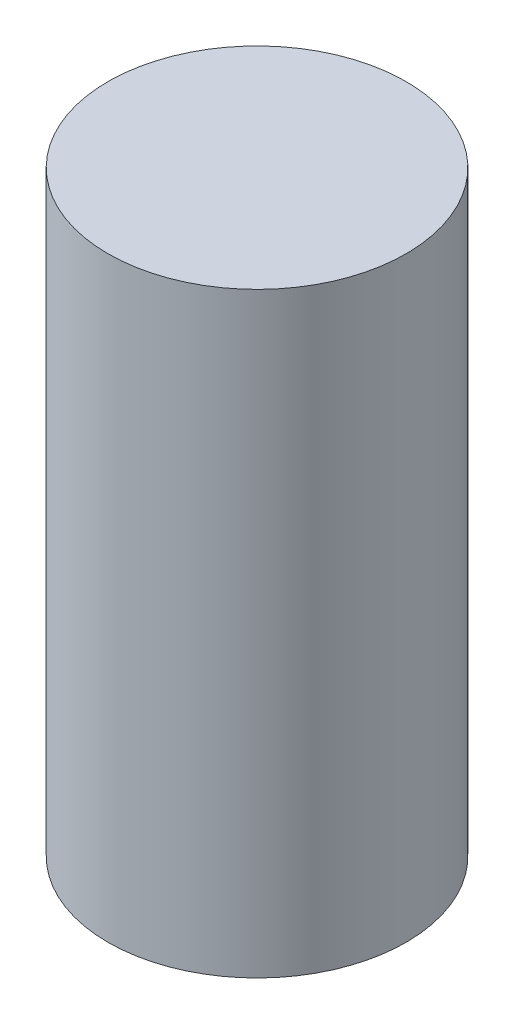
ISO-10303-21;
HEADER;
FILE_DESCRIPTION(('STEP AP214'),'2;1');
FILE_NAME('part.step','',(''),(''),'','','');
FILE_SCHEMA(('AUTOMOTIVE_DESIGN { 1 0 10303 214 1 1 1 1 }'));
ENDSEC;
DATA;
#1=APPLICATION_CONTEXT('core data for automotive mechanical design processes');
#2=APPLICATION_PROTOCOL_DEFINITION('international standard','automotive_design',2000,#1);
#3=PRODUCT_CONTEXT('',#1,'mechanical');
#4=PRODUCT('Part','Part','',(#3));
#5=PRODUCT_RELATED_PRODUCT_CATEGORY('part','',(#4));
#6=PRODUCT_DEFINITION_FORMATION('','',#4);
#7=PRODUCT_DEFINITION_CONTEXT('part definition',#1,'design');
#8=PRODUCT_DEFINITION('design','',#6,#7);
#9=PRODUCT_DEFINITION_SHAPE('','',#8);
#10=(LENGTH_UNIT() NAMED_UNIT(*) SI_UNIT(.MILLI.,.METRE.));
#11=(NAMED_UNIT(*) PLANE_ANGLE_UNIT() SI_UNIT($,.RADIAN.));
#12=(NAMED_UNIT(*) SI_UNIT($,.STERADIAN.) SOLID_ANGLE_UNIT());
#13=UNCERTAINTY_MEASURE_WITH_UNIT(LENGTH_MEASURE(1.E-05),#10,'distance_accuracy_value','');
#14=(GEOMETRIC_REPRESENTATION_CONTEXT(3) GLOBAL_UNCERTAINTY_ASSIGNED_CONTEXT((#13)) GLOBAL_UNIT_ASSIGNED_CONTEXT((#10,
#11,#12)) REPRESENTATION_CONTEXT('',''));
#15=CARTESIAN_POINT('',(0.,0.,0.));
#16=DIRECTION('',(0.,0.,1.));
#17=DIRECTION('',(1.,0.,0.));
#18=AXIS2_PLACEMENT_3D('',#15,#16,#17);
#19=CARTESIAN_POINT('',(0.,3.175,0.));
#20=DIRECTION('',(0.,-1.,0.));
#21=DIRECTION('',(0.,0.,-1.));
#22=AXIS2_PLACEMENT_3D('',#19,#20,#21);
#23=CYLINDRICAL_SURFACE('',#22,0.79375);
#24=CARTESIAN_POINT('',(0.,3.175,0.));
#25=DIRECTION('',(0.,1.,0.));
#26=DIRECTION('',(0.,0.,1.));
#27=AXIS2_PLACEMENT_3D('',#24,#25,#26);
#28=CIRCLE('',#27,0.79375);
#29=CARTESIAN_POINT('',(0.,3.175,0.79375));
#30=VERTEX_POINT('',#29);
#31=EDGE_CURVE('E10',#30,#30,#28,.T.);
#32=ORIENTED_EDGE('',*,*,#31,.F.);
#33=EDGE_LOOP('',(#32));
#34=FACE_BOUND('',#33,.T.);
#35=CARTESIAN_POINT('',(0.,0.,0.));
#36=DIRECTION('',(0.,1.,0.));
#37=DIRECTION('',(0.,0.,1.));
#38=AXIS2_PLACEMENT_3D('',#35,#36,#37);
#39=CIRCLE('',#38,0.79375);
#40=CARTESIAN_POINT('',(0.,0.,0.79375));
#41=VERTEX_POINT('',#40);
#42=EDGE_CURVE('E46',#41,#41,#39,.T.);
#43=ORIENTED_EDGE('',*,*,#42,.T.);
#44=EDGE_LOOP('',(#43));
#45=FACE_BOUND('',#44,.T.);
#46=ADVANCED_FACE('F43',(#34,#45),#23,.T.);
#47=CARTESIAN_POINT('',(0.,3.175,0.));
#48=DIRECTION('',(0.,1.,0.));
#49=DIRECTION('',(0.,0.,1.));
#50=AXIS2_PLACEMENT_3D('',#47,#48,#49);
#51=PLANE('',#50);
#52=ORIENTED_EDGE('',*,*,#31,.T.);
#53=EDGE_LOOP('',(#52));
#54=FACE_BOUND('',#53,.T.);
#55=ADVANCED_FACE('F60',(#54),#51,.T.);
#56=CARTESIAN_POINT('',(0.,0.,0.));
#57=DIRECTION('',(0.,1.,0.));
#58=DIRECTION('',(0.,0.,1.));
#59=AXIS2_PLACEMENT_3D('',#56,#57,#58);
#60=PLANE('',#59);
#61=ORIENTED_EDGE('',*,*,#42,.F.);
#62=EDGE_LOOP('',(#61));
#63=FACE_BOUND('',#62,.T.);
#64=ADVANCED_FACE('F58',(#63),#60,.F.);
#65=CLOSED_SHELL('',(#46,#55,#64));
#66=MANIFOLD_SOLID_BREP('B2',#65);
#67=ADVANCED_BREP_SHAPE_REPRESENTATION('',(#18,#66),#14);
#68=SHAPE_DEFINITION_REPRESENTATION(#9,#67);
ENDSEC;
END-ISO-10303-21;
